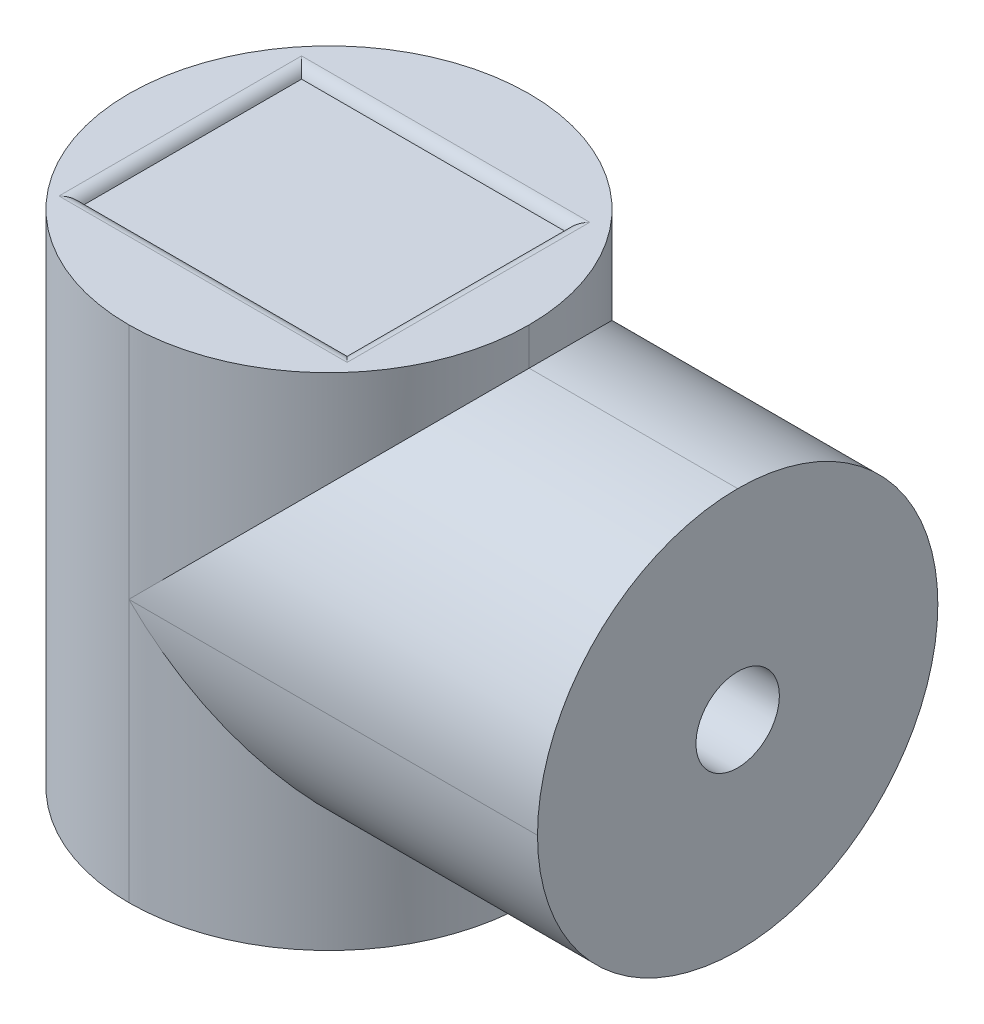
ISO-10303-21;
HEADER;
FILE_DESCRIPTION(('STEP AP214'),'2;1');
FILE_NAME('part.step','',(''),(''),'','','');
FILE_SCHEMA(('AUTOMOTIVE_DESIGN { 1 0 10303 214 1 1 1 1 }'));
ENDSEC;
DATA;
#1=APPLICATION_CONTEXT('core data for automotive mechanical design processes');
#2=APPLICATION_PROTOCOL_DEFINITION('international standard','automotive_design',2000,#1);
#3=PRODUCT_CONTEXT('',#1,'mechanical');
#4=PRODUCT('Part','Part','',(#3));
#5=PRODUCT_RELATED_PRODUCT_CATEGORY('part','',(#4));
#6=PRODUCT_DEFINITION_FORMATION('','',#4);
#7=PRODUCT_DEFINITION_CONTEXT('part definition',#1,'design');
#8=PRODUCT_DEFINITION('design','',#6,#7);
#9=PRODUCT_DEFINITION_SHAPE('','',#8);
#10=(LENGTH_UNIT() NAMED_UNIT(*) SI_UNIT(.MILLI.,.METRE.));
#11=(NAMED_UNIT(*) PLANE_ANGLE_UNIT() SI_UNIT($,.RADIAN.));
#12=(NAMED_UNIT(*) SI_UNIT($,.STERADIAN.) SOLID_ANGLE_UNIT());
#13=UNCERTAINTY_MEASURE_WITH_UNIT(LENGTH_MEASURE(1.E-05),#10,'distance_accuracy_value','');
#14=(GEOMETRIC_REPRESENTATION_CONTEXT(3) GLOBAL_UNCERTAINTY_ASSIGNED_CONTEXT((#13)) GLOBAL_UNIT_ASSIGNED_CONTEXT((#10,
#11,#12)) REPRESENTATION_CONTEXT('',''));
#15=CARTESIAN_POINT('',(0.,0.,0.));
#16=DIRECTION('',(0.,0.,1.));
#17=DIRECTION('',(1.,0.,0.));
#18=AXIS2_PLACEMENT_3D('',#15,#16,#17);
#19=CARTESIAN_POINT('',(0.,60.,0.));
#20=DIRECTION('',(0.,-1.,0.));
#21=DIRECTION('',(0.,0.,-1.));
#22=AXIS2_PLACEMENT_3D('',#19,#20,#21);
#23=PLANE('',#22);
#24=DIRECTION('',(0.,0.,1.));
#25=VECTOR('',#24,1.);
#26=CARTESIAN_POINT('',(40.982129937217,60.,0.));
#27=LINE('',#26,#25);
#28=CARTESIAN_POINT('',(40.982129937217,60.,-38.2844968909867));
#29=VERTEX_POINT('',#28);
#30=CARTESIAN_POINT('',(40.982129937217,60.,-9.19171250843076));
#31=VERTEX_POINT('',#30);
#32=EDGE_CURVE('E45',#29,#31,#27,.T.);
#33=ORIENTED_EDGE('',*,*,#32,.T.);
#34=DIRECTION('',(-1.,0.,0.));
#35=VECTOR('',#34,1.);
#36=CARTESIAN_POINT('',(0.,60.,-9.19171250843076));
#37=LINE('',#36,#35);
#38=CARTESIAN_POINT('',(6.42695786286591,60.,-9.19171250843076));
#39=VERTEX_POINT('',#38);
#40=EDGE_CURVE('E11',#31,#39,#37,.T.);
#41=ORIENTED_EDGE('',*,*,#40,.T.);
#42=DIRECTION('',(0.,0.,-1.));
#43=VECTOR('',#42,1.);
#44=CARTESIAN_POINT('',(6.42695786286591,60.,0.));
#45=LINE('',#44,#43);
#46=CARTESIAN_POINT('',(6.42695786286591,60.,-38.2844968909867));
#47=VERTEX_POINT('',#46);
#48=EDGE_CURVE('E230',#39,#47,#45,.T.);
#49=ORIENTED_EDGE('',*,*,#48,.T.);
#50=DIRECTION('',(1.,0.,0.));
#51=VECTOR('',#50,1.);
#52=CARTESIAN_POINT('',(0.,60.,-38.2844968909867));
#53=LINE('',#52,#51);
#54=EDGE_CURVE('E161',#47,#29,#53,.T.);
#55=ORIENTED_EDGE('',*,*,#54,.T.);
#56=EDGE_LOOP('',(#33,#41,#49,#55));
#57=FACE_BOUND('',#56,.T.);
#58=CARTESIAN_POINT('',(24.,60.,-24.));
#59=DIRECTION('',(0.,-1.,0.));
#60=DIRECTION('',(0.,0.,-1.));
#61=AXIS2_PLACEMENT_3D('',#58,#59,#60);
#62=CIRCLE('',#61,24.);
#63=CARTESIAN_POINT('',(24.,60.,-48.));
#64=VERTEX_POINT('',#63);
#65=CARTESIAN_POINT('',(0.,60.,-24.));
#66=VERTEX_POINT('',#65);
#67=EDGE_CURVE('E177',#64,#66,#62,.F.);
#68=ORIENTED_EDGE('',*,*,#67,.T.);
#69=CARTESIAN_POINT('',(24.,60.,-24.));
#70=DIRECTION('',(0.,-1.,0.));
#71=DIRECTION('',(0.,0.,-1.));
#72=AXIS2_PLACEMENT_3D('',#69,#70,#71);
#73=CIRCLE('',#72,24.);
#74=CARTESIAN_POINT('',(24.,60.,0.));
#75=VERTEX_POINT('',#74);
#76=EDGE_CURVE('E179',#66,#75,#73,.F.);
#77=ORIENTED_EDGE('',*,*,#76,.T.);
#78=CARTESIAN_POINT('',(24.,60.,-24.));
#79=DIRECTION('',(0.,-1.,0.));
#80=DIRECTION('',(0.,0.,-1.));
#81=AXIS2_PLACEMENT_3D('',#78,#79,#80);
#82=CIRCLE('',#81,24.);
#83=CARTESIAN_POINT('',(48.,60.,-24.));
#84=VERTEX_POINT('',#83);
#85=EDGE_CURVE('E173',#75,#84,#82,.F.);
#86=ORIENTED_EDGE('',*,*,#85,.T.);
#87=CARTESIAN_POINT('',(24.,60.,-24.));
#88=DIRECTION('',(0.,-1.,0.));
#89=DIRECTION('',(0.,0.,-1.));
#90=AXIS2_PLACEMENT_3D('',#87,#88,#89);
#91=CIRCLE('',#90,24.);
#92=EDGE_CURVE('E175',#84,#64,#91,.F.);
#93=ORIENTED_EDGE('',*,*,#92,.T.);
#94=EDGE_LOOP('',(#68,#77,#86,#93));
#95=FACE_BOUND('',#94,.T.);
#96=ADVANCED_FACE('F36',(#57,#95),#23,.F.);
#97=CARTESIAN_POINT('',(0.,0.,0.));
#98=DIRECTION('',(0.,-1.,0.));
#99=DIRECTION('',(0.,0.,-1.));
#100=AXIS2_PLACEMENT_3D('',#97,#98,#99);
#101=PLANE('',#100);
#102=CARTESIAN_POINT('',(24.,0.,-24.));
#103=DIRECTION('',(0.,-1.,0.));
#104=DIRECTION('',(0.,0.,-1.));
#105=AXIS2_PLACEMENT_3D('',#102,#103,#104);
#106=CIRCLE('',#105,5.);
#107=CARTESIAN_POINT('',(24.,0.,-29.));
#108=VERTEX_POINT('',#107);
#109=EDGE_CURVE('E158',#108,#108,#106,.T.);
#110=ORIENTED_EDGE('',*,*,#109,.F.);
#111=EDGE_LOOP('',(#110));
#112=FACE_BOUND('',#111,.T.);
#113=CARTESIAN_POINT('',(24.,0.,-24.));
#114=DIRECTION('',(0.,-1.,0.));
#115=DIRECTION('',(0.,0.,-1.));
#116=AXIS2_PLACEMENT_3D('',#113,#114,#115);
#117=CIRCLE('',#116,24.);
#118=CARTESIAN_POINT('',(48.,0.,-24.));
#119=VERTEX_POINT('',#118);
#120=CARTESIAN_POINT('',(24.,0.,0.));
#121=VERTEX_POINT('',#120);
#122=EDGE_CURVE('E163',#119,#121,#117,.T.);
#123=ORIENTED_EDGE('',*,*,#122,.T.);
#124=CARTESIAN_POINT('',(24.,0.,-24.));
#125=DIRECTION('',(0.,-1.,0.));
#126=DIRECTION('',(0.,0.,-1.));
#127=AXIS2_PLACEMENT_3D('',#124,#125,#126);
#128=CIRCLE('',#127,24.);
#129=CARTESIAN_POINT('',(0.,0.,-24.));
#130=VERTEX_POINT('',#129);
#131=EDGE_CURVE('E170',#121,#130,#128,.T.);
#132=ORIENTED_EDGE('',*,*,#131,.T.);
#133=CARTESIAN_POINT('',(24.,0.,-24.));
#134=DIRECTION('',(0.,-1.,0.));
#135=DIRECTION('',(0.,0.,-1.));
#136=AXIS2_PLACEMENT_3D('',#133,#134,#135);
#137=CIRCLE('',#136,24.);
#138=CARTESIAN_POINT('',(24.,0.,-48.));
#139=VERTEX_POINT('',#138);
#140=EDGE_CURVE('E168',#130,#139,#137,.T.);
#141=ORIENTED_EDGE('',*,*,#140,.T.);
#142=CARTESIAN_POINT('',(24.,0.,-24.));
#143=DIRECTION('',(0.,-1.,0.));
#144=DIRECTION('',(0.,0.,-1.));
#145=AXIS2_PLACEMENT_3D('',#142,#143,#144);
#146=CIRCLE('',#145,24.);
#147=EDGE_CURVE('E165',#139,#119,#146,.T.);
#148=ORIENTED_EDGE('',*,*,#147,.T.);
#149=EDGE_LOOP('',(#123,#132,#141,#148));
#150=FACE_BOUND('',#149,.T.);
#151=ADVANCED_FACE('F241',(#112,#150),#101,.T.);
#152=CARTESIAN_POINT('',(73.,0.,0.));
#153=DIRECTION('',(1.,0.,0.));
#154=DIRECTION('',(0.,0.,-1.));
#155=AXIS2_PLACEMENT_3D('',#152,#153,#154);
#156=PLANE('',#155);
#157=CARTESIAN_POINT('',(73.,31.5,-24.));
#158=DIRECTION('',(1.,0.,0.));
#159=DIRECTION('',(0.,0.,-1.));
#160=AXIS2_PLACEMENT_3D('',#157,#158,#159);
#161=CIRCLE('',#160,5.);
#162=CARTESIAN_POINT('',(73.,31.5,-29.));
#163=VERTEX_POINT('',#162);
#164=EDGE_CURVE('E148',#163,#163,#161,.T.);
#165=ORIENTED_EDGE('',*,*,#164,.F.);
#166=EDGE_LOOP('',(#165));
#167=FACE_BOUND('',#166,.T.);
#168=CARTESIAN_POINT('',(73.,31.5,-24.));
#169=DIRECTION('',(1.,0.,0.));
#170=DIRECTION('',(0.,0.,-1.));
#171=AXIS2_PLACEMENT_3D('',#168,#169,#170);
#172=CIRCLE('',#171,24.);
#173=CARTESIAN_POINT('',(73.,55.5,-24.));
#174=VERTEX_POINT('',#173);
#175=CARTESIAN_POINT('',(73.,31.5,0.));
#176=VERTEX_POINT('',#175);
#177=EDGE_CURVE('E186',#174,#176,#172,.T.);
#178=ORIENTED_EDGE('',*,*,#177,.T.);
#179=CARTESIAN_POINT('',(73.,31.5,-24.));
#180=DIRECTION('',(1.,0.,0.));
#181=DIRECTION('',(0.,0.,-1.));
#182=AXIS2_PLACEMENT_3D('',#179,#180,#181);
#183=CIRCLE('',#182,24.);
#184=CARTESIAN_POINT('',(73.,7.5,-24.));
#185=VERTEX_POINT('',#184);
#186=EDGE_CURVE('E162',#176,#185,#183,.T.);
#187=ORIENTED_EDGE('',*,*,#186,.T.);
#188=CARTESIAN_POINT('',(73.,31.5,-24.));
#189=DIRECTION('',(1.,0.,0.));
#190=DIRECTION('',(0.,0.,-1.));
#191=AXIS2_PLACEMENT_3D('',#188,#189,#190);
#192=CIRCLE('',#191,24.);
#193=CARTESIAN_POINT('',(73.,31.5,-48.));
#194=VERTEX_POINT('',#193);
#195=EDGE_CURVE('E184',#185,#194,#192,.T.);
#196=ORIENTED_EDGE('',*,*,#195,.T.);
#197=CARTESIAN_POINT('',(73.,31.5,-24.));
#198=DIRECTION('',(1.,0.,0.));
#199=DIRECTION('',(0.,0.,-1.));
#200=AXIS2_PLACEMENT_3D('',#197,#198,#199);
#201=CIRCLE('',#200,24.);
#202=EDGE_CURVE('E182',#194,#174,#201,.T.);
#203=ORIENTED_EDGE('',*,*,#202,.T.);
#204=EDGE_LOOP('',(#178,#187,#196,#203));
#205=FACE_BOUND('',#204,.T.);
#206=ADVANCED_FACE('F289',(#167,#205),#156,.T.);
#207=CARTESIAN_POINT('',(73.,31.5,-24.));
#208=DIRECTION('',(-1.,0.,0.));
#209=DIRECTION('',(0.,0.,1.));
#210=AXIS2_PLACEMENT_3D('',#207,#208,#209);
#211=CYLINDRICAL_SURFACE('',#210,24.);
#212=DIRECTION('',(-1.,0.,0.));
#213=VECTOR('',#212,1.);
#214=CARTESIAN_POINT('',(73.,55.5,-24.));
#215=LINE('',#214,#213);
#216=CARTESIAN_POINT('',(48.,55.5,-24.));
#217=VERTEX_POINT('',#216);
#218=EDGE_CURVE('E221',#174,#217,#215,.T.);
#219=ORIENTED_EDGE('',*,*,#218,.F.);
#220=ORIENTED_EDGE('',*,*,#202,.F.);
#221=DIRECTION('',(-1.,0.,0.));
#222=VECTOR('',#221,1.);
#223=CARTESIAN_POINT('',(0.,31.5,-48.));
#224=LINE('',#223,#222);
#225=CARTESIAN_POINT('',(24.,31.5,-48.));
#226=VERTEX_POINT('',#225);
#227=EDGE_CURVE('E166',#226,#194,#224,.F.);
#228=ORIENTED_EDGE('',*,*,#227,.F.);
#229=CARTESIAN_POINT('',(24.,31.5,-24.));
#230=DIRECTION('',(0.707106781186547,-0.707106781186547,0.));
#231=DIRECTION('',(-0.707106781186547,-0.707106781186547,0.));
#232=AXIS2_PLACEMENT_3D('',#229,#230,#231);
#233=ELLIPSE('',#232,33.9411254969543,24.);
#234=EDGE_CURVE('E224',#217,#226,#233,.F.);
#235=ORIENTED_EDGE('',*,*,#234,.F.);
#236=EDGE_LOOP('',(#219,#220,#228,#235));
#237=FACE_BOUND('',#236,.T.);
#238=ADVANCED_FACE('F285',(#237),#211,.T.);
#239=CARTESIAN_POINT('',(0.,31.5,-24.));
#240=DIRECTION('',(-1.,0.,0.));
#241=DIRECTION('',(0.,0.,1.));
#242=AXIS2_PLACEMENT_3D('',#239,#240,#241);
#243=CYLINDRICAL_SURFACE('',#242,24.);
#244=ORIENTED_EDGE('',*,*,#227,.T.);
#245=ORIENTED_EDGE('',*,*,#195,.F.);
#246=DIRECTION('',(-1.,0.,0.));
#247=VECTOR('',#246,1.);
#248=CARTESIAN_POINT('',(73.,7.5,-24.));
#249=LINE('',#248,#247);
#250=CARTESIAN_POINT('',(48.,7.5,-24.));
#251=VERTEX_POINT('',#250);
#252=EDGE_CURVE('E217',#251,#185,#249,.F.);
#253=ORIENTED_EDGE('',*,*,#252,.F.);
#254=CARTESIAN_POINT('',(24.,31.5,-24.));
#255=DIRECTION('',(-0.707106781186547,-0.707106781186547,0.));
#256=DIRECTION('',(0.707106781186547,-0.707106781186547,0.));
#257=AXIS2_PLACEMENT_3D('',#254,#255,#256);
#258=ELLIPSE('',#257,33.9411254969543,24.);
#259=EDGE_CURVE('E214',#226,#251,#258,.T.);
#260=ORIENTED_EDGE('',*,*,#259,.F.);
#261=EDGE_LOOP('',(#244,#245,#253,#260));
#262=FACE_BOUND('',#261,.T.);
#263=ADVANCED_FACE('F287',(#262),#243,.T.);
#264=CARTESIAN_POINT('',(24.,60.,-24.));
#265=DIRECTION('',(0.,-1.,0.));
#266=DIRECTION('',(0.,0.,-1.));
#267=AXIS2_PLACEMENT_3D('',#264,#265,#266);
#268=CYLINDRICAL_SURFACE('',#267,24.);
#269=DIRECTION('',(0.,-1.,0.));
#270=VECTOR('',#269,1.);
#271=CARTESIAN_POINT('',(48.,60.,-24.));
#272=LINE('',#271,#270);
#273=EDGE_CURVE('E205',#217,#84,#272,.F.);
#274=ORIENTED_EDGE('',*,*,#273,.F.);
#275=ORIENTED_EDGE('',*,*,#234,.T.);
#276=DIRECTION('',(0.,-1.,0.));
#277=VECTOR('',#276,1.);
#278=CARTESIAN_POINT('',(24.,60.,-48.));
#279=LINE('',#278,#277);
#280=EDGE_CURVE('E208',#64,#226,#279,.T.);
#281=ORIENTED_EDGE('',*,*,#280,.F.);
#282=ORIENTED_EDGE('',*,*,#92,.F.);
#283=EDGE_LOOP('',(#274,#275,#281,#282));
#284=FACE_BOUND('',#283,.T.);
#285=ADVANCED_FACE('F261',(#284),#268,.T.);
#286=CARTESIAN_POINT('',(0.,31.5,-24.));
#287=DIRECTION('',(-1.,0.,0.));
#288=DIRECTION('',(0.,0.,1.));
#289=AXIS2_PLACEMENT_3D('',#286,#287,#288);
#290=CYLINDRICAL_SURFACE('',#289,24.);
#291=DIRECTION('',(-1.,0.,0.));
#292=VECTOR('',#291,1.);
#293=CARTESIAN_POINT('',(0.,31.5,0.));
#294=LINE('',#293,#292);
#295=CARTESIAN_POINT('',(24.,31.5,0.));
#296=VERTEX_POINT('',#295);
#297=EDGE_CURVE('E219',#176,#296,#294,.T.);
#298=ORIENTED_EDGE('',*,*,#297,.F.);
#299=ORIENTED_EDGE('',*,*,#177,.F.);
#300=ORIENTED_EDGE('',*,*,#218,.T.);
#301=CARTESIAN_POINT('',(24.,31.5,-24.));
#302=DIRECTION('',(0.707106781186547,-0.707106781186547,0.));
#303=DIRECTION('',(-0.707106781186547,-0.707106781186547,0.));
#304=AXIS2_PLACEMENT_3D('',#301,#302,#303);
#305=ELLIPSE('',#304,33.9411254969543,24.);
#306=EDGE_CURVE('E202',#296,#217,#305,.F.);
#307=ORIENTED_EDGE('',*,*,#306,.F.);
#308=EDGE_LOOP('',(#298,#299,#300,#307));
#309=FACE_BOUND('',#308,.T.);
#310=ADVANCED_FACE('F281',(#309),#290,.T.);
#311=CARTESIAN_POINT('',(73.,31.5,-24.));
#312=DIRECTION('',(-1.,0.,0.));
#313=DIRECTION('',(0.,0.,1.));
#314=AXIS2_PLACEMENT_3D('',#311,#312,#313);
#315=CYLINDRICAL_SURFACE('',#314,24.);
#316=ORIENTED_EDGE('',*,*,#186,.F.);
#317=ORIENTED_EDGE('',*,*,#297,.T.);
#318=CARTESIAN_POINT('',(24.,31.5,-24.));
#319=DIRECTION('',(-0.707106781186547,-0.707106781186547,0.));
#320=DIRECTION('',(0.707106781186547,-0.707106781186547,0.));
#321=AXIS2_PLACEMENT_3D('',#318,#319,#320);
#322=ELLIPSE('',#321,33.9411254969543,24.);
#323=EDGE_CURVE('E199',#251,#296,#322,.T.);
#324=ORIENTED_EDGE('',*,*,#323,.F.);
#325=ORIENTED_EDGE('',*,*,#252,.T.);
#326=EDGE_LOOP('',(#316,#317,#324,#325));
#327=FACE_BOUND('',#326,.T.);
#328=ADVANCED_FACE('F275',(#327),#315,.T.);
#329=CARTESIAN_POINT('',(24.,60.,-24.));
#330=DIRECTION('',(0.,-1.,0.));
#331=DIRECTION('',(0.,0.,-1.));
#332=AXIS2_PLACEMENT_3D('',#329,#330,#331);
#333=CYLINDRICAL_SURFACE('',#332,24.);
#334=DIRECTION('',(0.,-1.,0.));
#335=VECTOR('',#334,1.);
#336=CARTESIAN_POINT('',(48.,60.,-24.));
#337=LINE('',#336,#335);
#338=EDGE_CURVE('E196',#119,#251,#337,.F.);
#339=ORIENTED_EDGE('',*,*,#338,.F.);
#340=ORIENTED_EDGE('',*,*,#147,.F.);
#341=DIRECTION('',(0.,-1.,0.));
#342=VECTOR('',#341,1.);
#343=CARTESIAN_POINT('',(24.,60.,-48.));
#344=LINE('',#343,#342);
#345=EDGE_CURVE('E211',#226,#139,#344,.T.);
#346=ORIENTED_EDGE('',*,*,#345,.F.);
#347=ORIENTED_EDGE('',*,*,#259,.T.);
#348=EDGE_LOOP('',(#339,#340,#346,#347));
#349=FACE_BOUND('',#348,.T.);
#350=ADVANCED_FACE('F267',(#349),#333,.T.);
#351=CARTESIAN_POINT('',(24.,60.,-24.));
#352=DIRECTION('',(0.,-1.,0.));
#353=DIRECTION('',(0.,0.,-1.));
#354=AXIS2_PLACEMENT_3D('',#351,#352,#353);
#355=CYLINDRICAL_SURFACE('',#354,24.);
#356=ORIENTED_EDGE('',*,*,#345,.T.);
#357=ORIENTED_EDGE('',*,*,#140,.F.);
#358=DIRECTION('',(0.,-1.,0.));
#359=VECTOR('',#358,1.);
#360=CARTESIAN_POINT('',(0.,60.,-24.));
#361=LINE('',#360,#359);
#362=EDGE_CURVE('E194',#66,#130,#361,.T.);
#363=ORIENTED_EDGE('',*,*,#362,.F.);
#364=ORIENTED_EDGE('',*,*,#67,.F.);
#365=ORIENTED_EDGE('',*,*,#280,.T.);
#366=EDGE_LOOP('',(#356,#357,#363,#364,#365));
#367=FACE_BOUND('',#366,.T.);
#368=ADVANCED_FACE('F250',(#367),#355,.T.);
#369=CARTESIAN_POINT('',(24.,60.,-24.));
#370=DIRECTION('',(0.,-1.,0.));
#371=DIRECTION('',(0.,0.,-1.));
#372=AXIS2_PLACEMENT_3D('',#369,#370,#371);
#373=CYLINDRICAL_SURFACE('',#372,24.);
#374=ORIENTED_EDGE('',*,*,#273,.T.);
#375=ORIENTED_EDGE('',*,*,#85,.F.);
#376=DIRECTION('',(0.,-1.,0.));
#377=VECTOR('',#376,1.);
#378=CARTESIAN_POINT('',(24.,60.,0.));
#379=LINE('',#378,#377);
#380=EDGE_CURVE('E192',#296,#75,#379,.F.);
#381=ORIENTED_EDGE('',*,*,#380,.F.);
#382=ORIENTED_EDGE('',*,*,#306,.T.);
#383=EDGE_LOOP('',(#374,#375,#381,#382));
#384=FACE_BOUND('',#383,.T.);
#385=ADVANCED_FACE('F258',(#384),#373,.T.);
#386=CARTESIAN_POINT('',(24.,60.,-24.));
#387=DIRECTION('',(0.,-1.,0.));
#388=DIRECTION('',(0.,0.,-1.));
#389=AXIS2_PLACEMENT_3D('',#386,#387,#388);
#390=CYLINDRICAL_SURFACE('',#389,24.);
#391=ORIENTED_EDGE('',*,*,#338,.T.);
#392=ORIENTED_EDGE('',*,*,#323,.T.);
#393=DIRECTION('',(0.,-1.,0.));
#394=VECTOR('',#393,1.);
#395=CARTESIAN_POINT('',(24.,60.,0.));
#396=LINE('',#395,#394);
#397=EDGE_CURVE('E157',#121,#296,#396,.F.);
#398=ORIENTED_EDGE('',*,*,#397,.F.);
#399=ORIENTED_EDGE('',*,*,#122,.F.);
#400=EDGE_LOOP('',(#391,#392,#398,#399));
#401=FACE_BOUND('',#400,.T.);
#402=ADVANCED_FACE('F272',(#401),#390,.T.);
#403=CARTESIAN_POINT('',(24.,60.,-24.));
#404=DIRECTION('',(0.,-1.,0.));
#405=DIRECTION('',(0.,0.,-1.));
#406=AXIS2_PLACEMENT_3D('',#403,#404,#405);
#407=CYLINDRICAL_SURFACE('',#406,24.);
#408=ORIENTED_EDGE('',*,*,#76,.F.);
#409=ORIENTED_EDGE('',*,*,#362,.T.);
#410=ORIENTED_EDGE('',*,*,#131,.F.);
#411=ORIENTED_EDGE('',*,*,#397,.T.);
#412=ORIENTED_EDGE('',*,*,#380,.T.);
#413=EDGE_LOOP('',(#408,#409,#410,#411,#412));
#414=FACE_BOUND('',#413,.T.);
#415=ADVANCED_FACE('F253',(#414),#407,.T.);
#416=CARTESIAN_POINT('',(24.,-10.,-24.));
#417=DIRECTION('',(0.,1.,0.));
#418=DIRECTION('',(0.,0.,1.));
#419=AXIS2_PLACEMENT_3D('',#416,#417,#418);
#420=CYLINDRICAL_SURFACE('',#419,5.);
#421=CARTESIAN_POINT('',(24.,-10.,-24.));
#422=DIRECTION('',(0.,-1.,0.));
#423=DIRECTION('',(0.,0.,-1.));
#424=AXIS2_PLACEMENT_3D('',#421,#422,#423);
#425=CIRCLE('',#424,5.);
#426=CARTESIAN_POINT('',(24.,-10.,-29.));
#427=VERTEX_POINT('',#426);
#428=EDGE_CURVE('E152',#427,#427,#425,.T.);
#429=ORIENTED_EDGE('',*,*,#428,.F.);
#430=EDGE_LOOP('',(#429));
#431=FACE_BOUND('',#430,.T.);
#432=ORIENTED_EDGE('',*,*,#109,.T.);
#433=EDGE_LOOP('',(#432));
#434=FACE_BOUND('',#433,.T.);
#435=ADVANCED_FACE('F302',(#431,#434),#420,.T.);
#436=CARTESIAN_POINT('',(24.,-10.,-24.));
#437=DIRECTION('',(0.,-1.,0.));
#438=DIRECTION('',(0.,0.,-1.));
#439=AXIS2_PLACEMENT_3D('',#436,#437,#438);
#440=PLANE('',#439);
#441=ORIENTED_EDGE('',*,*,#428,.T.);
#442=EDGE_LOOP('',(#441));
#443=FACE_BOUND('',#442,.T.);
#444=ADVANCED_FACE('F343',(#443),#440,.T.);
#445=CARTESIAN_POINT('',(58.,31.5,-24.));
#446=DIRECTION('',(1.,0.,0.));
#447=DIRECTION('',(0.,0.,-1.));
#448=AXIS2_PLACEMENT_3D('',#445,#446,#447);
#449=CYLINDRICAL_SURFACE('',#448,5.);
#450=CARTESIAN_POINT('',(58.,31.5,-24.));
#451=DIRECTION('',(1.,0.,0.));
#452=DIRECTION('',(0.,0.,-1.));
#453=AXIS2_PLACEMENT_3D('',#450,#451,#452);
#454=CIRCLE('',#453,5.);
#455=CARTESIAN_POINT('',(58.,31.5,-29.));
#456=VERTEX_POINT('',#455);
#457=EDGE_CURVE('E149',#456,#456,#454,.T.);
#458=ORIENTED_EDGE('',*,*,#457,.F.);
#459=EDGE_LOOP('',(#458));
#460=FACE_BOUND('',#459,.T.);
#461=ORIENTED_EDGE('',*,*,#164,.T.);
#462=EDGE_LOOP('',(#461));
#463=FACE_BOUND('',#462,.T.);
#464=ADVANCED_FACE('F338',(#460,#463),#449,.F.);
#465=CARTESIAN_POINT('',(58.,31.5,-24.));
#466=DIRECTION('',(1.,0.,0.));
#467=DIRECTION('',(0.,0.,-1.));
#468=AXIS2_PLACEMENT_3D('',#465,#466,#467);
#469=PLANE('',#468);
#470=ORIENTED_EDGE('',*,*,#457,.T.);
#471=EDGE_LOOP('',(#470));
#472=FACE_BOUND('',#471,.T.);
#473=ADVANCED_FACE('F333',(#472),#469,.T.);
#474=CARTESIAN_POINT('',(0.,59.,0.));
#475=DIRECTION('',(0.,1.,0.));
#476=DIRECTION('',(0.,0.,1.));
#477=AXIS2_PLACEMENT_3D('',#474,#475,#476);
#478=PLANE('',#477);
#479=DIRECTION('',(0.,0.,1.));
#480=VECTOR('',#479,1.);
#481=CARTESIAN_POINT('',(7.84117142523901,59.,-36.8702833286136));
#482=LINE('',#481,#480);
#483=CARTESIAN_POINT('',(7.84117142523901,59.,-36.8702833286136));
#484=VERTEX_POINT('',#483);
#485=CARTESIAN_POINT('',(7.84117142523901,59.,-10.6059260708039));
#486=VERTEX_POINT('',#485);
#487=EDGE_CURVE('E143',#484,#486,#482,.T.);
#488=ORIENTED_EDGE('',*,*,#487,.T.);
#489=DIRECTION('',(1.,0.,0.));
#490=VECTOR('',#489,1.);
#491=CARTESIAN_POINT('',(7.84117142523901,59.,-10.6059260708039));
#492=LINE('',#491,#490);
#493=CARTESIAN_POINT('',(39.5679163748439,59.,-10.6059260708039));
#494=VERTEX_POINT('',#493);
#495=EDGE_CURVE('E129',#486,#494,#492,.T.);
#496=ORIENTED_EDGE('',*,*,#495,.T.);
#497=DIRECTION('',(0.,0.,-1.));
#498=VECTOR('',#497,1.);
#499=CARTESIAN_POINT('',(39.5679163748439,59.,-36.8702833286136));
#500=LINE('',#499,#498);
#501=CARTESIAN_POINT('',(39.5679163748439,59.,-36.8702833286136));
#502=VERTEX_POINT('',#501);
#503=EDGE_CURVE('E133',#494,#502,#500,.T.);
#504=ORIENTED_EDGE('',*,*,#503,.T.);
#505=DIRECTION('',(-1.,0.,0.));
#506=VECTOR('',#505,1.);
#507=CARTESIAN_POINT('',(7.84117142523901,59.,-36.8702833286136));
#508=LINE('',#507,#506);
#509=EDGE_CURVE('E139',#502,#484,#508,.T.);
#510=ORIENTED_EDGE('',*,*,#509,.T.);
#511=EDGE_LOOP('',(#488,#496,#504,#510));
#512=FACE_BOUND('',#511,.T.);
#513=ADVANCED_FACE('F141',(#512),#478,.T.);
#514=CARTESIAN_POINT('',(7.84117142523901,58.5,-38.2844968909867));
#515=DIRECTION('',(1.,0.,0.));
#516=DIRECTION('',(0.,0.,-1.));
#517=AXIS2_PLACEMENT_3D('',#514,#515,#516);
#518=CYLINDRICAL_SURFACE('',#517,1.5);
#519=CARTESIAN_POINT('',(40.982129937217,58.5,-38.2844968909867));
#520=DIRECTION('',(0.707106781186547,0.,0.707106781186547));
#521=DIRECTION('',(-0.707106781186547,0.,0.707106781186547));
#522=AXIS2_PLACEMENT_3D('',#519,#520,#521);
#523=ELLIPSE('',#522,2.12132034355964,1.5);
#524=EDGE_CURVE('E136',#29,#502,#523,.T.);
#525=ORIENTED_EDGE('',*,*,#524,.F.);
#526=ORIENTED_EDGE('',*,*,#54,.F.);
#527=CARTESIAN_POINT('',(6.42695786286591,58.5,-38.2844968909867));
#528=DIRECTION('',(0.707106781186547,0.,-0.707106781186547));
#529=DIRECTION('',(-0.707106781186547,0.,-0.707106781186547));
#530=AXIS2_PLACEMENT_3D('',#527,#528,#529);
#531=ELLIPSE('',#530,2.12132034355964,1.5);
#532=EDGE_CURVE('E40',#484,#47,#531,.F.);
#533=ORIENTED_EDGE('',*,*,#532,.F.);
#534=ORIENTED_EDGE('',*,*,#509,.F.);
#535=EDGE_LOOP('',(#525,#526,#533,#534));
#536=FACE_BOUND('',#535,.T.);
#537=ADVANCED_FACE('F38',(#536),#518,.T.);
#538=CARTESIAN_POINT('',(6.42695786286591,58.5,-36.8702833286136));
#539=DIRECTION('',(0.,0.,-1.));
#540=DIRECTION('',(-1.,0.,0.));
#541=AXIS2_PLACEMENT_3D('',#538,#539,#540);
#542=CYLINDRICAL_SURFACE('',#541,1.5);
#543=ORIENTED_EDGE('',*,*,#532,.T.);
#544=ORIENTED_EDGE('',*,*,#48,.F.);
#545=CARTESIAN_POINT('',(6.42695786286591,58.5,-9.19171250843076));
#546=DIRECTION('',(-0.707106781186547,0.,-0.707106781186547));
#547=DIRECTION('',(-0.707106781186547,0.,0.707106781186547));
#548=AXIS2_PLACEMENT_3D('',#545,#546,#547);
#549=ELLIPSE('',#548,2.12132034355964,1.5);
#550=EDGE_CURVE('E58',#486,#39,#549,.F.);
#551=ORIENTED_EDGE('',*,*,#550,.F.);
#552=ORIENTED_EDGE('',*,*,#487,.F.);
#553=EDGE_LOOP('',(#543,#544,#551,#552));
#554=FACE_BOUND('',#553,.T.);
#555=ADVANCED_FACE('F236',(#554),#542,.T.);
#556=CARTESIAN_POINT('',(40.982129937217,58.5,-36.8702833286136));
#557=DIRECTION('',(0.,0.,1.));
#558=DIRECTION('',(1.,0.,0.));
#559=AXIS2_PLACEMENT_3D('',#556,#557,#558);
#560=CYLINDRICAL_SURFACE('',#559,1.5);
#561=ORIENTED_EDGE('',*,*,#524,.T.);
#562=ORIENTED_EDGE('',*,*,#503,.F.);
#563=CARTESIAN_POINT('',(40.982129937217,58.5,-9.19171250843076));
#564=DIRECTION('',(-0.707106781186547,0.,0.707106781186547));
#565=DIRECTION('',(-0.707106781186547,0.,-0.707106781186547));
#566=AXIS2_PLACEMENT_3D('',#563,#564,#565);
#567=ELLIPSE('',#566,2.12132034355964,1.5);
#568=EDGE_CURVE('E125',#31,#494,#567,.T.);
#569=ORIENTED_EDGE('',*,*,#568,.F.);
#570=ORIENTED_EDGE('',*,*,#32,.F.);
#571=EDGE_LOOP('',(#561,#562,#569,#570));
#572=FACE_BOUND('',#571,.T.);
#573=ADVANCED_FACE('F134',(#572),#560,.T.);
#574=CARTESIAN_POINT('',(7.84117142523901,58.5,-9.19171250843076));
#575=DIRECTION('',(-1.,0.,0.));
#576=DIRECTION('',(0.,0.,1.));
#577=AXIS2_PLACEMENT_3D('',#574,#575,#576);
#578=CYLINDRICAL_SURFACE('',#577,1.5);
#579=ORIENTED_EDGE('',*,*,#550,.T.);
#580=ORIENTED_EDGE('',*,*,#40,.F.);
#581=ORIENTED_EDGE('',*,*,#568,.T.);
#582=ORIENTED_EDGE('',*,*,#495,.F.);
#583=EDGE_LOOP('',(#579,#580,#581,#582));
#584=FACE_BOUND('',#583,.T.);
#585=ADVANCED_FACE('F127',(#584),#578,.T.);
#586=CLOSED_SHELL('',(#96,#151,#206,#238,#263,#285,#310,#328,#350,#368,#385,#402,#415,#435,#444,
#464,#473,#513,#537,#555,#573,#585));
#587=MANIFOLD_SOLID_BREP('B2',#586);
#588=ADVANCED_BREP_SHAPE_REPRESENTATION('',(#18,#587),#14);
#589=SHAPE_DEFINITION_REPRESENTATION(#9,#588);
ENDSEC;
END-ISO-10303-21;
